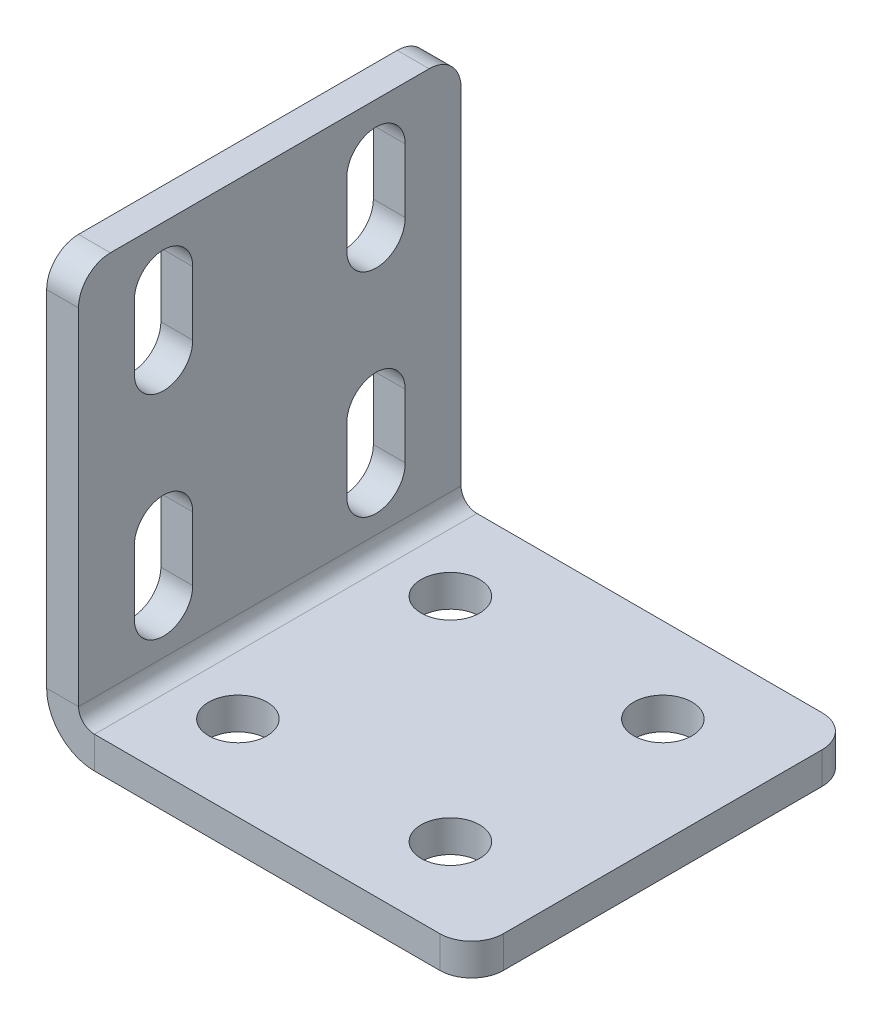
ISO-10303-21;
HEADER;
FILE_DESCRIPTION(('STEP AP214'),'2;1');
FILE_NAME('part.step','',(''),(''),'','','');
FILE_SCHEMA(('AUTOMOTIVE_DESIGN { 1 0 10303 214 1 1 1 1 }'));
ENDSEC;
DATA;
#1=APPLICATION_CONTEXT('core data for automotive mechanical design processes');
#2=APPLICATION_PROTOCOL_DEFINITION('international standard','automotive_design',2000,#1);
#3=PRODUCT_CONTEXT('',#1,'mechanical');
#4=PRODUCT('Part','Part','',(#3));
#5=PRODUCT_RELATED_PRODUCT_CATEGORY('part','',(#4));
#6=PRODUCT_DEFINITION_FORMATION('','',#4);
#7=PRODUCT_DEFINITION_CONTEXT('part definition',#1,'design');
#8=PRODUCT_DEFINITION('design','',#6,#7);
#9=PRODUCT_DEFINITION_SHAPE('','',#8);
#10=(LENGTH_UNIT() NAMED_UNIT(*) SI_UNIT(.MILLI.,.METRE.));
#11=(NAMED_UNIT(*) PLANE_ANGLE_UNIT() SI_UNIT($,.RADIAN.));
#12=(NAMED_UNIT(*) SI_UNIT($,.STERADIAN.) SOLID_ANGLE_UNIT());
#13=UNCERTAINTY_MEASURE_WITH_UNIT(LENGTH_MEASURE(1.E-05),#10,'distance_accuracy_value','');
#14=(GEOMETRIC_REPRESENTATION_CONTEXT(3) GLOBAL_UNCERTAINTY_ASSIGNED_CONTEXT((#13)) GLOBAL_UNIT_ASSIGNED_CONTEXT((#10,
#11,#12)) REPRESENTATION_CONTEXT('',''));
#15=CARTESIAN_POINT('',(0.,0.,0.));
#16=DIRECTION('',(0.,0.,1.));
#17=DIRECTION('',(1.,0.,0.));
#18=AXIS2_PLACEMENT_3D('',#15,#16,#17);
#19=CARTESIAN_POINT('',(0.,29.,-9.99999999999999));
#20=DIRECTION('',(-1.,0.,0.));
#21=DIRECTION('',(0.,0.,1.));
#22=AXIS2_PLACEMENT_3D('',#19,#20,#21);
#23=CYLINDRICAL_SURFACE('',#22,2.75);
#24=CARTESIAN_POINT('',(3.,29.,-9.99999999999999));
#25=DIRECTION('',(1.,0.,0.));
#26=DIRECTION('',(0.,0.,-1.));
#27=AXIS2_PLACEMENT_3D('',#24,#25,#26);
#28=CIRCLE('',#27,2.75);
#29=CARTESIAN_POINT('',(3.,29.,-7.24999999999999));
#30=VERTEX_POINT('',#29);
#31=CARTESIAN_POINT('',(3.,29.,-12.75));
#32=VERTEX_POINT('',#31);
#33=EDGE_CURVE('E496',#30,#32,#28,.T.);
#34=ORIENTED_EDGE('',*,*,#33,.T.);
#35=DIRECTION('',(1.,0.,0.));
#36=VECTOR('',#35,1.);
#37=CARTESIAN_POINT('',(0.,29.,-12.75));
#38=LINE('',#37,#36);
#39=CARTESIAN_POINT('',(0.,29.,-12.75));
#40=VERTEX_POINT('',#39);
#41=EDGE_CURVE('E308',#40,#32,#38,.T.);
#42=ORIENTED_EDGE('',*,*,#41,.F.);
#43=CARTESIAN_POINT('',(0.,29.,-9.99999999999999));
#44=DIRECTION('',(1.,0.,0.));
#45=DIRECTION('',(0.,0.,-1.));
#46=AXIS2_PLACEMENT_3D('',#43,#44,#45);
#47=CIRCLE('',#46,2.75);
#48=CARTESIAN_POINT('',(0.,29.,-7.24999999999999));
#49=VERTEX_POINT('',#48);
#50=EDGE_CURVE('E385',#49,#40,#47,.T.);
#51=ORIENTED_EDGE('',*,*,#50,.F.);
#52=DIRECTION('',(1.,0.,0.));
#53=VECTOR('',#52,1.);
#54=CARTESIAN_POINT('',(0.,29.,-7.24999999999999));
#55=LINE('',#54,#53);
#56=EDGE_CURVE('E311',#49,#30,#55,.T.);
#57=ORIENTED_EDGE('',*,*,#56,.T.);
#58=EDGE_LOOP('',(#34,#42,#51,#57));
#59=FACE_BOUND('',#58,.T.);
#60=ADVANCED_FACE('F46',(#59),#23,.F.);
#61=CARTESIAN_POINT('',(0.,9.,10.));
#62=DIRECTION('',(-1.,0.,0.));
#63=DIRECTION('',(0.,0.,1.));
#64=AXIS2_PLACEMENT_3D('',#61,#62,#63);
#65=CYLINDRICAL_SURFACE('',#64,2.75);
#66=CARTESIAN_POINT('',(3.,9.,10.));
#67=DIRECTION('',(1.,0.,0.));
#68=DIRECTION('',(0.,0.,-1.));
#69=AXIS2_PLACEMENT_3D('',#66,#67,#68);
#70=CIRCLE('',#69,2.75);
#71=CARTESIAN_POINT('',(3.,9.,12.75));
#72=VERTEX_POINT('',#71);
#73=CARTESIAN_POINT('',(3.,9.,7.25));
#74=VERTEX_POINT('',#73);
#75=EDGE_CURVE('E513',#72,#74,#70,.T.);
#76=ORIENTED_EDGE('',*,*,#75,.T.);
#77=DIRECTION('',(1.,0.,0.));
#78=VECTOR('',#77,1.);
#79=CARTESIAN_POINT('',(0.,9.,7.25));
#80=LINE('',#79,#78);
#81=CARTESIAN_POINT('',(0.,9.,7.25));
#82=VERTEX_POINT('',#81);
#83=EDGE_CURVE('E375',#82,#74,#80,.T.);
#84=ORIENTED_EDGE('',*,*,#83,.F.);
#85=CARTESIAN_POINT('',(0.,9.,10.));
#86=DIRECTION('',(1.,0.,0.));
#87=DIRECTION('',(0.,0.,-1.));
#88=AXIS2_PLACEMENT_3D('',#85,#86,#87);
#89=CIRCLE('',#88,2.75);
#90=CARTESIAN_POINT('',(0.,9.,12.75));
#91=VERTEX_POINT('',#90);
#92=EDGE_CURVE('E389',#91,#82,#89,.T.);
#93=ORIENTED_EDGE('',*,*,#92,.F.);
#94=DIRECTION('',(1.,0.,0.));
#95=VECTOR('',#94,1.);
#96=CARTESIAN_POINT('',(0.,9.,12.75));
#97=LINE('',#96,#95);
#98=EDGE_CURVE('E378',#91,#72,#97,.T.);
#99=ORIENTED_EDGE('',*,*,#98,.T.);
#100=EDGE_LOOP('',(#76,#84,#93,#99));
#101=FACE_BOUND('',#100,.T.);
#102=ADVANCED_FACE('F659',(#101),#65,.F.);
#103=CARTESIAN_POINT('',(0.,29.,10.));
#104=DIRECTION('',(-1.,0.,0.));
#105=DIRECTION('',(0.,0.,1.));
#106=AXIS2_PLACEMENT_3D('',#103,#104,#105);
#107=CYLINDRICAL_SURFACE('',#106,2.75);
#108=CARTESIAN_POINT('',(3.,29.,10.));
#109=DIRECTION('',(1.,0.,0.));
#110=DIRECTION('',(0.,0.,-1.));
#111=AXIS2_PLACEMENT_3D('',#108,#109,#110);
#112=CIRCLE('',#111,2.75);
#113=CARTESIAN_POINT('',(3.,29.,12.75));
#114=VERTEX_POINT('',#113);
#115=CARTESIAN_POINT('',(3.,29.,7.25));
#116=VERTEX_POINT('',#115);
#117=EDGE_CURVE('E517',#114,#116,#112,.T.);
#118=ORIENTED_EDGE('',*,*,#117,.T.);
#119=DIRECTION('',(1.,0.,0.));
#120=VECTOR('',#119,1.);
#121=CARTESIAN_POINT('',(0.,29.,7.25));
#122=LINE('',#121,#120);
#123=CARTESIAN_POINT('',(0.,29.,7.25));
#124=VERTEX_POINT('',#123);
#125=EDGE_CURVE('E341',#124,#116,#122,.T.);
#126=ORIENTED_EDGE('',*,*,#125,.F.);
#127=CARTESIAN_POINT('',(0.,29.,10.));
#128=DIRECTION('',(1.,0.,0.));
#129=DIRECTION('',(0.,0.,-1.));
#130=AXIS2_PLACEMENT_3D('',#127,#128,#129);
#131=CIRCLE('',#130,2.75);
#132=CARTESIAN_POINT('',(0.,29.,12.75));
#133=VERTEX_POINT('',#132);
#134=EDGE_CURVE('E394',#133,#124,#131,.T.);
#135=ORIENTED_EDGE('',*,*,#134,.F.);
#136=DIRECTION('',(1.,0.,0.));
#137=VECTOR('',#136,1.);
#138=CARTESIAN_POINT('',(0.,29.,12.75));
#139=LINE('',#138,#137);
#140=EDGE_CURVE('E344',#133,#114,#139,.T.);
#141=ORIENTED_EDGE('',*,*,#140,.T.);
#142=EDGE_LOOP('',(#118,#126,#135,#141));
#143=FACE_BOUND('',#142,.T.);
#144=ADVANCED_FACE('F665',(#143),#107,.F.);
#145=CARTESIAN_POINT('',(0.,8.99999999999999,-9.99999999999999));
#146=DIRECTION('',(-1.,0.,0.));
#147=DIRECTION('',(0.,0.,1.));
#148=AXIS2_PLACEMENT_3D('',#145,#146,#147);
#149=CYLINDRICAL_SURFACE('',#148,2.75);
#150=CARTESIAN_POINT('',(3.,8.99999999999999,-9.99999999999999));
#151=DIRECTION('',(1.,0.,0.));
#152=DIRECTION('',(0.,0.,-1.));
#153=AXIS2_PLACEMENT_3D('',#150,#151,#152);
#154=CIRCLE('',#153,2.75);
#155=CARTESIAN_POINT('',(3.,8.99999999999999,-7.24999999999999));
#156=VERTEX_POINT('',#155);
#157=CARTESIAN_POINT('',(3.,8.99999999999999,-12.75));
#158=VERTEX_POINT('',#157);
#159=EDGE_CURVE('E506',#156,#158,#154,.T.);
#160=ORIENTED_EDGE('',*,*,#159,.T.);
#161=DIRECTION('',(1.,0.,0.));
#162=VECTOR('',#161,1.);
#163=CARTESIAN_POINT('',(0.,8.99999999999999,-12.75));
#164=LINE('',#163,#162);
#165=CARTESIAN_POINT('',(0.,8.99999999999999,-12.75));
#166=VERTEX_POINT('',#165);
#167=EDGE_CURVE('E279',#166,#158,#164,.T.);
#168=ORIENTED_EDGE('',*,*,#167,.F.);
#169=CARTESIAN_POINT('',(0.,8.99999999999999,-9.99999999999999));
#170=DIRECTION('',(1.,0.,0.));
#171=DIRECTION('',(0.,0.,-1.));
#172=AXIS2_PLACEMENT_3D('',#169,#170,#171);
#173=CIRCLE('',#172,2.75);
#174=CARTESIAN_POINT('',(0.,8.99999999999999,-7.24999999999999));
#175=VERTEX_POINT('',#174);
#176=EDGE_CURVE('E398',#175,#166,#173,.T.);
#177=ORIENTED_EDGE('',*,*,#176,.F.);
#178=DIRECTION('',(1.,0.,0.));
#179=VECTOR('',#178,1.);
#180=CARTESIAN_POINT('',(0.,8.99999999999999,-7.24999999999999));
#181=LINE('',#180,#179);
#182=EDGE_CURVE('E243',#175,#156,#181,.T.);
#183=ORIENTED_EDGE('',*,*,#182,.T.);
#184=EDGE_LOOP('',(#160,#168,#177,#183));
#185=FACE_BOUND('',#184,.T.);
#186=ADVANCED_FACE('F673',(#185),#149,.F.);
#187=CARTESIAN_POINT('',(0.,0.,18.));
#188=DIRECTION('',(0.,0.,-1.));
#189=DIRECTION('',(0.,-1.,0.));
#190=AXIS2_PLACEMENT_3D('',#187,#188,#189);
#191=PLANE('',#190);
#192=DIRECTION('',(0.,1.,0.));
#193=VECTOR('',#192,1.);
#194=CARTESIAN_POINT('',(3.,0.,18.));
#195=LINE('',#194,#193);
#196=CARTESIAN_POINT('',(3.,37.,18.));
#197=VERTEX_POINT('',#196);
#198=CARTESIAN_POINT('',(3.,4.5,18.));
#199=VERTEX_POINT('',#198);
#200=EDGE_CURVE('E503',#197,#199,#195,.F.);
#201=ORIENTED_EDGE('',*,*,#200,.F.);
#202=DIRECTION('',(1.,0.,0.));
#203=VECTOR('',#202,1.);
#204=CARTESIAN_POINT('',(0.,37.,18.));
#205=LINE('',#204,#203);
#206=CARTESIAN_POINT('',(0.,37.,18.));
#207=VERTEX_POINT('',#206);
#208=EDGE_CURVE('E11',#197,#207,#205,.F.);
#209=ORIENTED_EDGE('',*,*,#208,.T.);
#210=DIRECTION('',(0.,-1.,0.));
#211=VECTOR('',#210,1.);
#212=CARTESIAN_POINT('',(0.,0.,18.));
#213=LINE('',#212,#211);
#214=CARTESIAN_POINT('',(0.,4.5,18.));
#215=VERTEX_POINT('',#214);
#216=EDGE_CURVE('E401',#207,#215,#213,.T.);
#217=ORIENTED_EDGE('',*,*,#216,.T.);
#218=DIRECTION('',(-1.,0.,0.));
#219=VECTOR('',#218,1.);
#220=CARTESIAN_POINT('',(0.,4.5,18.));
#221=LINE('',#220,#219);
#222=EDGE_CURVE('E531',#199,#215,#221,.T.);
#223=ORIENTED_EDGE('',*,*,#222,.F.);
#224=EDGE_LOOP('',(#201,#209,#217,#223));
#225=FACE_BOUND('',#224,.T.);
#226=ADVANCED_FACE('F616',(#225),#191,.F.);
#227=CARTESIAN_POINT('',(0.,40.,-18.));
#228=DIRECTION('',(0.,-1.,0.));
#229=DIRECTION('',(0.,0.,1.));
#230=AXIS2_PLACEMENT_3D('',#227,#228,#229);
#231=PLANE('',#230);
#232=DIRECTION('',(0.,0.,1.));
#233=VECTOR('',#232,1.);
#234=CARTESIAN_POINT('',(3.,40.,-18.));
#235=LINE('',#234,#233);
#236=CARTESIAN_POINT('',(3.,40.,-15.));
#237=VERTEX_POINT('',#236);
#238=CARTESIAN_POINT('',(3.,40.,15.));
#239=VERTEX_POINT('',#238);
#240=EDGE_CURVE('E499',#237,#239,#235,.T.);
#241=ORIENTED_EDGE('',*,*,#240,.F.);
#242=DIRECTION('',(-1.,0.,0.));
#243=VECTOR('',#242,1.);
#244=CARTESIAN_POINT('',(0.,40.,-15.));
#245=LINE('',#244,#243);
#246=CARTESIAN_POINT('',(0.,40.,-15.));
#247=VERTEX_POINT('',#246);
#248=EDGE_CURVE('E566',#237,#247,#245,.T.);
#249=ORIENTED_EDGE('',*,*,#248,.T.);
#250=DIRECTION('',(0.,0.,1.));
#251=VECTOR('',#250,1.);
#252=CARTESIAN_POINT('',(0.,40.,-18.));
#253=LINE('',#252,#251);
#254=CARTESIAN_POINT('',(0.,40.,15.));
#255=VERTEX_POINT('',#254);
#256=EDGE_CURVE('E404',#247,#255,#253,.T.);
#257=ORIENTED_EDGE('',*,*,#256,.T.);
#258=DIRECTION('',(1.,0.,0.));
#259=VECTOR('',#258,1.);
#260=CARTESIAN_POINT('',(0.,40.,15.));
#261=LINE('',#260,#259);
#262=EDGE_CURVE('E563',#255,#239,#261,.T.);
#263=ORIENTED_EDGE('',*,*,#262,.T.);
#264=EDGE_LOOP('',(#241,#249,#257,#263));
#265=FACE_BOUND('',#264,.T.);
#266=ADVANCED_FACE('F594',(#265),#231,.F.);
#267=CARTESIAN_POINT('',(0.,0.,-18.));
#268=DIRECTION('',(0.,0.,-1.));
#269=DIRECTION('',(0.,-1.,0.));
#270=AXIS2_PLACEMENT_3D('',#267,#268,#269);
#271=PLANE('',#270);
#272=DIRECTION('',(0.,-1.,0.));
#273=VECTOR('',#272,1.);
#274=CARTESIAN_POINT('',(0.,0.,-18.));
#275=LINE('',#274,#273);
#276=CARTESIAN_POINT('',(0.,37.,-18.));
#277=VERTEX_POINT('',#276);
#278=CARTESIAN_POINT('',(0.,4.5,-18.));
#279=VERTEX_POINT('',#278);
#280=EDGE_CURVE('E408',#277,#279,#275,.T.);
#281=ORIENTED_EDGE('',*,*,#280,.F.);
#282=DIRECTION('',(1.,0.,0.));
#283=VECTOR('',#282,1.);
#284=CARTESIAN_POINT('',(0.,37.,-18.));
#285=LINE('',#284,#283);
#286=CARTESIAN_POINT('',(3.,37.,-18.));
#287=VERTEX_POINT('',#286);
#288=EDGE_CURVE('E576',#277,#287,#285,.T.);
#289=ORIENTED_EDGE('',*,*,#288,.T.);
#290=DIRECTION('',(0.,1.,0.));
#291=VECTOR('',#290,1.);
#292=CARTESIAN_POINT('',(3.,0.,-18.));
#293=LINE('',#292,#291);
#294=CARTESIAN_POINT('',(3.,4.5,-18.));
#295=VERTEX_POINT('',#294);
#296=EDGE_CURVE('E469',#287,#295,#293,.F.);
#297=ORIENTED_EDGE('',*,*,#296,.T.);
#298=DIRECTION('',(-1.,0.,0.));
#299=VECTOR('',#298,1.);
#300=CARTESIAN_POINT('',(0.,4.5,-18.));
#301=LINE('',#300,#299);
#302=EDGE_CURVE('E527',#295,#279,#301,.T.);
#303=ORIENTED_EDGE('',*,*,#302,.T.);
#304=EDGE_LOOP('',(#281,#289,#297,#303));
#305=FACE_BOUND('',#304,.T.);
#306=ADVANCED_FACE('F601',(#305),#271,.T.);
#307=CARTESIAN_POINT('',(4.5,4.5,-18.));
#308=DIRECTION('',(0.,0.,1.));
#309=DIRECTION('',(1.,0.,0.));
#310=AXIS2_PLACEMENT_3D('',#307,#308,#309);
#311=PLANE('',#310);
#312=ORIENTED_EDGE('',*,*,#302,.F.);
#313=CARTESIAN_POINT('',(4.5,4.5,-18.));
#314=DIRECTION('',(0.,0.,1.));
#315=DIRECTION('',(1.,0.,0.));
#316=AXIS2_PLACEMENT_3D('',#313,#314,#315);
#317=CIRCLE('',#316,1.5);
#318=CARTESIAN_POINT('',(4.5,3.,-18.));
#319=VERTEX_POINT('',#318);
#320=EDGE_CURVE('E492',#295,#319,#317,.T.);
#321=ORIENTED_EDGE('',*,*,#320,.T.);
#322=DIRECTION('',(0.,-1.,0.));
#323=VECTOR('',#322,1.);
#324=CARTESIAN_POINT('',(4.5,0.,-18.));
#325=LINE('',#324,#323);
#326=CARTESIAN_POINT('',(4.5,0.,-18.));
#327=VERTEX_POINT('',#326);
#328=EDGE_CURVE('E524',#319,#327,#325,.T.);
#329=ORIENTED_EDGE('',*,*,#328,.T.);
#330=CARTESIAN_POINT('',(4.5,4.5,-18.));
#331=DIRECTION('',(0.,0.,-1.));
#332=DIRECTION('',(-1.,0.,0.));
#333=AXIS2_PLACEMENT_3D('',#330,#331,#332);
#334=CIRCLE('',#333,4.5);
#335=EDGE_CURVE('E390',#279,#327,#334,.F.);
#336=ORIENTED_EDGE('',*,*,#335,.F.);
#337=EDGE_LOOP('',(#312,#321,#329,#336));
#338=FACE_BOUND('',#337,.T.);
#339=ADVANCED_FACE('F606',(#338),#311,.F.);
#340=CARTESIAN_POINT('',(40.,0.,-18.));
#341=DIRECTION('',(0.,0.,-1.));
#342=DIRECTION('',(1.,0.,0.));
#343=AXIS2_PLACEMENT_3D('',#340,#341,#342);
#344=PLANE('',#343);
#345=DIRECTION('',(1.,0.,0.));
#346=VECTOR('',#345,1.);
#347=CARTESIAN_POINT('',(40.,3.,-18.));
#348=LINE('',#347,#346);
#349=CARTESIAN_POINT('',(37.,3.,-18.));
#350=VERTEX_POINT('',#349);
#351=EDGE_CURVE('E463',#319,#350,#348,.T.);
#352=ORIENTED_EDGE('',*,*,#351,.T.);
#353=DIRECTION('',(0.,-1.,0.));
#354=VECTOR('',#353,1.);
#355=CARTESIAN_POINT('',(37.,0.,-18.));
#356=LINE('',#355,#354);
#357=CARTESIAN_POINT('',(37.,0.,-18.));
#358=VERTEX_POINT('',#357);
#359=EDGE_CURVE('E535',#350,#358,#356,.T.);
#360=ORIENTED_EDGE('',*,*,#359,.T.);
#361=DIRECTION('',(1.,0.,0.));
#362=VECTOR('',#361,1.);
#363=CARTESIAN_POINT('',(40.,0.,-18.));
#364=LINE('',#363,#362);
#365=EDGE_CURVE('E435',#327,#358,#364,.T.);
#366=ORIENTED_EDGE('',*,*,#365,.F.);
#367=ORIENTED_EDGE('',*,*,#328,.F.);
#368=EDGE_LOOP('',(#352,#360,#366,#367));
#369=FACE_BOUND('',#368,.T.);
#370=ADVANCED_FACE('F649',(#369),#344,.T.);
#371=CARTESIAN_POINT('',(40.,0.,-18.));
#372=DIRECTION('',(1.,0.,0.));
#373=DIRECTION('',(0.,0.,1.));
#374=AXIS2_PLACEMENT_3D('',#371,#372,#373);
#375=PLANE('',#374);
#376=DIRECTION('',(0.,0.,1.));
#377=VECTOR('',#376,1.);
#378=CARTESIAN_POINT('',(40.,0.,-18.));
#379=LINE('',#378,#377);
#380=CARTESIAN_POINT('',(40.,0.,-15.));
#381=VERTEX_POINT('',#380);
#382=CARTESIAN_POINT('',(40.,0.,15.));
#383=VERTEX_POINT('',#382);
#384=EDGE_CURVE('E427',#381,#383,#379,.T.);
#385=ORIENTED_EDGE('',*,*,#384,.F.);
#386=DIRECTION('',(0.,-1.,0.));
#387=VECTOR('',#386,1.);
#388=CARTESIAN_POINT('',(40.,0.,-15.));
#389=LINE('',#388,#387);
#390=CARTESIAN_POINT('',(40.,3.,-15.));
#391=VERTEX_POINT('',#390);
#392=EDGE_CURVE('E551',#381,#391,#389,.F.);
#393=ORIENTED_EDGE('',*,*,#392,.T.);
#394=DIRECTION('',(0.,0.,1.));
#395=VECTOR('',#394,1.);
#396=CARTESIAN_POINT('',(40.,3.,-18.));
#397=LINE('',#396,#395);
#398=CARTESIAN_POINT('',(40.,3.,15.));
#399=VERTEX_POINT('',#398);
#400=EDGE_CURVE('E481',#391,#399,#397,.T.);
#401=ORIENTED_EDGE('',*,*,#400,.T.);
#402=DIRECTION('',(0.,1.,0.));
#403=VECTOR('',#402,1.);
#404=CARTESIAN_POINT('',(40.,0.,15.));
#405=LINE('',#404,#403);
#406=EDGE_CURVE('E547',#399,#383,#405,.F.);
#407=ORIENTED_EDGE('',*,*,#406,.T.);
#408=EDGE_LOOP('',(#385,#393,#401,#407));
#409=FACE_BOUND('',#408,.T.);
#410=ADVANCED_FACE('F640',(#409),#375,.T.);
#411=CARTESIAN_POINT('',(40.,0.,18.));
#412=DIRECTION('',(0.,0.,-1.));
#413=DIRECTION('',(1.,0.,0.));
#414=AXIS2_PLACEMENT_3D('',#411,#412,#413);
#415=PLANE('',#414);
#416=DIRECTION('',(1.,0.,0.));
#417=VECTOR('',#416,1.);
#418=CARTESIAN_POINT('',(40.,0.,18.));
#419=LINE('',#418,#417);
#420=CARTESIAN_POINT('',(4.5,0.,18.));
#421=VERTEX_POINT('',#420);
#422=CARTESIAN_POINT('',(37.,0.,18.));
#423=VERTEX_POINT('',#422);
#424=EDGE_CURVE('E431',#421,#423,#419,.T.);
#425=ORIENTED_EDGE('',*,*,#424,.T.);
#426=DIRECTION('',(0.,-1.,0.));
#427=VECTOR('',#426,1.);
#428=CARTESIAN_POINT('',(37.,0.,18.));
#429=LINE('',#428,#427);
#430=CARTESIAN_POINT('',(37.,3.,18.));
#431=VERTEX_POINT('',#430);
#432=EDGE_CURVE('E560',#423,#431,#429,.F.);
#433=ORIENTED_EDGE('',*,*,#432,.T.);
#434=DIRECTION('',(1.,0.,0.));
#435=VECTOR('',#434,1.);
#436=CARTESIAN_POINT('',(40.,3.,18.));
#437=LINE('',#436,#435);
#438=CARTESIAN_POINT('',(4.5,3.,18.));
#439=VERTEX_POINT('',#438);
#440=EDGE_CURVE('E482',#439,#431,#437,.T.);
#441=ORIENTED_EDGE('',*,*,#440,.F.);
#442=DIRECTION('',(0.,-1.,0.));
#443=VECTOR('',#442,1.);
#444=CARTESIAN_POINT('',(4.5,0.,18.));
#445=LINE('',#444,#443);
#446=EDGE_CURVE('E447',#439,#421,#445,.T.);
#447=ORIENTED_EDGE('',*,*,#446,.T.);
#448=EDGE_LOOP('',(#425,#433,#441,#447));
#449=FACE_BOUND('',#448,.T.);
#450=ADVANCED_FACE('F627',(#449),#415,.F.);
#451=CARTESIAN_POINT('',(10.,0.,-10.));
#452=DIRECTION('',(0.,-1.,0.));
#453=DIRECTION('',(1.,0.,0.));
#454=AXIS2_PLACEMENT_3D('',#451,#452,#453);
#455=CYLINDRICAL_SURFACE('',#454,2.75);
#456=CARTESIAN_POINT('',(10.,0.,-10.));
#457=DIRECTION('',(0.,-1.,0.));
#458=DIRECTION('',(0.,0.,-1.));
#459=AXIS2_PLACEMENT_3D('',#456,#457,#458);
#460=CIRCLE('',#459,2.75);
#461=CARTESIAN_POINT('',(10.,0.,-12.75));
#462=VERTEX_POINT('',#461);
#463=EDGE_CURVE('E411',#462,#462,#460,.T.);
#464=ORIENTED_EDGE('',*,*,#463,.T.);
#465=EDGE_LOOP('',(#464));
#466=FACE_BOUND('',#465,.T.);
#467=CARTESIAN_POINT('',(10.,3.,-10.));
#468=DIRECTION('',(0.,-1.,0.));
#469=DIRECTION('',(0.,0.,-1.));
#470=AXIS2_PLACEMENT_3D('',#467,#468,#469);
#471=CIRCLE('',#470,2.75);
#472=CARTESIAN_POINT('',(10.,3.,-12.75));
#473=VERTEX_POINT('',#472);
#474=EDGE_CURVE('E464',#473,#473,#471,.T.);
#475=ORIENTED_EDGE('',*,*,#474,.F.);
#476=EDGE_LOOP('',(#475));
#477=FACE_BOUND('',#476,.T.);
#478=ADVANCED_FACE('F717',(#466,#477),#455,.F.);
#479=CARTESIAN_POINT('',(30.,0.,10.));
#480=DIRECTION('',(0.,-1.,0.));
#481=DIRECTION('',(1.,0.,0.));
#482=AXIS2_PLACEMENT_3D('',#479,#480,#481);
#483=CYLINDRICAL_SURFACE('',#482,2.75);
#484=CARTESIAN_POINT('',(30.,0.,10.));
#485=DIRECTION('',(0.,-1.,0.));
#486=DIRECTION('',(0.,0.,-1.));
#487=AXIS2_PLACEMENT_3D('',#484,#485,#486);
#488=CIRCLE('',#487,2.75);
#489=CARTESIAN_POINT('',(30.,0.,7.25000000000001));
#490=VERTEX_POINT('',#489);
#491=EDGE_CURVE('E415',#490,#490,#488,.T.);
#492=ORIENTED_EDGE('',*,*,#491,.T.);
#493=EDGE_LOOP('',(#492));
#494=FACE_BOUND('',#493,.T.);
#495=CARTESIAN_POINT('',(30.,3.,10.));
#496=DIRECTION('',(0.,-1.,0.));
#497=DIRECTION('',(0.,0.,-1.));
#498=AXIS2_PLACEMENT_3D('',#495,#496,#497);
#499=CIRCLE('',#498,2.75);
#500=CARTESIAN_POINT('',(30.,3.,7.25000000000001));
#501=VERTEX_POINT('',#500);
#502=EDGE_CURVE('E468',#501,#501,#499,.T.);
#503=ORIENTED_EDGE('',*,*,#502,.F.);
#504=EDGE_LOOP('',(#503));
#505=FACE_BOUND('',#504,.T.);
#506=ADVANCED_FACE('F720',(#494,#505),#483,.F.);
#507=CARTESIAN_POINT('',(30.,0.,-9.99999999999999));
#508=DIRECTION('',(0.,-1.,0.));
#509=DIRECTION('',(1.,0.,0.));
#510=AXIS2_PLACEMENT_3D('',#507,#508,#509);
#511=CYLINDRICAL_SURFACE('',#510,2.75);
#512=CARTESIAN_POINT('',(30.,0.,-9.99999999999999));
#513=DIRECTION('',(0.,-1.,0.));
#514=DIRECTION('',(0.,0.,-1.));
#515=AXIS2_PLACEMENT_3D('',#512,#513,#514);
#516=CIRCLE('',#515,2.75);
#517=CARTESIAN_POINT('',(30.,0.,-12.75));
#518=VERTEX_POINT('',#517);
#519=EDGE_CURVE('E419',#518,#518,#516,.T.);
#520=ORIENTED_EDGE('',*,*,#519,.T.);
#521=EDGE_LOOP('',(#520));
#522=FACE_BOUND('',#521,.T.);
#523=CARTESIAN_POINT('',(30.,3.,-9.99999999999999));
#524=DIRECTION('',(0.,-1.,0.));
#525=DIRECTION('',(0.,0.,-1.));
#526=AXIS2_PLACEMENT_3D('',#523,#524,#525);
#527=CIRCLE('',#526,2.75);
#528=CARTESIAN_POINT('',(30.,3.,-12.75));
#529=VERTEX_POINT('',#528);
#530=EDGE_CURVE('E473',#529,#529,#527,.T.);
#531=ORIENTED_EDGE('',*,*,#530,.F.);
#532=EDGE_LOOP('',(#531));
#533=FACE_BOUND('',#532,.T.);
#534=ADVANCED_FACE('F724',(#522,#533),#511,.F.);
#535=CARTESIAN_POINT('',(10.,0.,10.));
#536=DIRECTION('',(0.,-1.,0.));
#537=DIRECTION('',(1.,0.,0.));
#538=AXIS2_PLACEMENT_3D('',#535,#536,#537);
#539=CYLINDRICAL_SURFACE('',#538,2.75);
#540=CARTESIAN_POINT('',(10.,0.,10.));
#541=DIRECTION('',(0.,-1.,0.));
#542=DIRECTION('',(0.,0.,-1.));
#543=AXIS2_PLACEMENT_3D('',#540,#541,#542);
#544=CIRCLE('',#543,2.75);
#545=CARTESIAN_POINT('',(10.,0.,7.25000000000001));
#546=VERTEX_POINT('',#545);
#547=EDGE_CURVE('E423',#546,#546,#544,.T.);
#548=ORIENTED_EDGE('',*,*,#547,.T.);
#549=EDGE_LOOP('',(#548));
#550=FACE_BOUND('',#549,.T.);
#551=CARTESIAN_POINT('',(10.,3.,10.));
#552=DIRECTION('',(0.,-1.,0.));
#553=DIRECTION('',(0.,0.,-1.));
#554=AXIS2_PLACEMENT_3D('',#551,#552,#553);
#555=CIRCLE('',#554,2.75);
#556=CARTESIAN_POINT('',(10.,3.,7.25000000000001));
#557=VERTEX_POINT('',#556);
#558=EDGE_CURVE('E477',#557,#557,#555,.T.);
#559=ORIENTED_EDGE('',*,*,#558,.F.);
#560=EDGE_LOOP('',(#559));
#561=FACE_BOUND('',#560,.T.);
#562=ADVANCED_FACE('F728',(#550,#561),#539,.F.);
#563=CARTESIAN_POINT('',(4.5,4.5,18.));
#564=DIRECTION('',(0.,0.,-1.));
#565=DIRECTION('',(-1.,0.,0.));
#566=AXIS2_PLACEMENT_3D('',#563,#564,#565);
#567=PLANE('',#566);
#568=CARTESIAN_POINT('',(4.5,4.5,18.));
#569=DIRECTION('',(0.,0.,1.));
#570=DIRECTION('',(1.,0.,0.));
#571=AXIS2_PLACEMENT_3D('',#568,#569,#570);
#572=CIRCLE('',#571,1.5);
#573=EDGE_CURVE('E374',#439,#199,#572,.F.);
#574=ORIENTED_EDGE('',*,*,#573,.T.);
#575=ORIENTED_EDGE('',*,*,#222,.T.);
#576=CARTESIAN_POINT('',(4.5,4.5,18.));
#577=DIRECTION('',(0.,0.,1.));
#578=DIRECTION('',(1.,0.,0.));
#579=AXIS2_PLACEMENT_3D('',#576,#577,#578);
#580=CIRCLE('',#579,4.5);
#581=EDGE_CURVE('E448',#421,#215,#580,.F.);
#582=ORIENTED_EDGE('',*,*,#581,.F.);
#583=ORIENTED_EDGE('',*,*,#446,.F.);
#584=EDGE_LOOP('',(#574,#575,#582,#583));
#585=FACE_BOUND('',#584,.T.);
#586=ADVANCED_FACE('F619',(#585),#567,.F.);
#587=CARTESIAN_POINT('',(40.,0.,-18.));
#588=DIRECTION('',(0.,-1.,0.));
#589=DIRECTION('',(1.,0.,0.));
#590=AXIS2_PLACEMENT_3D('',#587,#588,#589);
#591=PLANE('',#590);
#592=ORIENTED_EDGE('',*,*,#463,.F.);
#593=EDGE_LOOP('',(#592));
#594=FACE_BOUND('',#593,.T.);
#595=ORIENTED_EDGE('',*,*,#491,.F.);
#596=EDGE_LOOP('',(#595));
#597=FACE_BOUND('',#596,.T.);
#598=ORIENTED_EDGE('',*,*,#519,.F.);
#599=EDGE_LOOP('',(#598));
#600=FACE_BOUND('',#599,.T.);
#601=ORIENTED_EDGE('',*,*,#547,.F.);
#602=EDGE_LOOP('',(#601));
#603=FACE_BOUND('',#602,.T.);
#604=ORIENTED_EDGE('',*,*,#365,.T.);
#605=CARTESIAN_POINT('',(37.,0.,-15.));
#606=DIRECTION('',(0.,-1.,0.));
#607=DIRECTION('',(1.,0.,0.));
#608=AXIS2_PLACEMENT_3D('',#605,#606,#607);
#609=CIRCLE('',#608,3.);
#610=EDGE_CURVE('E544',#358,#381,#609,.T.);
#611=ORIENTED_EDGE('',*,*,#610,.T.);
#612=ORIENTED_EDGE('',*,*,#384,.T.);
#613=CARTESIAN_POINT('',(37.,0.,15.));
#614=DIRECTION('',(0.,-1.,0.));
#615=DIRECTION('',(1.,0.,0.));
#616=AXIS2_PLACEMENT_3D('',#613,#614,#615);
#617=CIRCLE('',#616,3.);
#618=EDGE_CURVE('E541',#383,#423,#617,.T.);
#619=ORIENTED_EDGE('',*,*,#618,.T.);
#620=ORIENTED_EDGE('',*,*,#424,.F.);
#621=DIRECTION('',(0.,0.,1.));
#622=VECTOR('',#621,1.);
#623=CARTESIAN_POINT('',(4.5,0.,-18.));
#624=LINE('',#623,#622);
#625=EDGE_CURVE('E443',#421,#327,#624,.F.);
#626=ORIENTED_EDGE('',*,*,#625,.T.);
#627=EDGE_LOOP('',(#604,#611,#612,#619,#620,#626));
#628=FACE_BOUND('',#627,.T.);
#629=ADVANCED_FACE('F643',(#594,#597,#600,#603,#628),#591,.T.);
#630=CARTESIAN_POINT('',(0.,0.,-18.));
#631=DIRECTION('',(-1.,0.,0.));
#632=DIRECTION('',(0.,0.,1.));
#633=AXIS2_PLACEMENT_3D('',#630,#631,#632);
#634=PLANE('',#633);
#635=DIRECTION('',(0.,1.,0.));
#636=VECTOR('',#635,1.);
#637=CARTESIAN_POINT('',(0.,35.,7.25));
#638=LINE('',#637,#636);
#639=CARTESIAN_POINT('',(0.,35.,7.25));
#640=VERTEX_POINT('',#639);
#641=EDGE_CURVE('E326',#124,#640,#638,.T.);
#642=ORIENTED_EDGE('',*,*,#641,.T.);
#643=CARTESIAN_POINT('',(0.,35.,10.));
#644=DIRECTION('',(1.,0.,0.));
#645=DIRECTION('',(0.,0.,-1.));
#646=AXIS2_PLACEMENT_3D('',#643,#644,#645);
#647=CIRCLE('',#646,2.75);
#648=CARTESIAN_POINT('',(0.,35.,12.75));
#649=VERTEX_POINT('',#648);
#650=EDGE_CURVE('E317',#640,#649,#647,.T.);
#651=ORIENTED_EDGE('',*,*,#650,.T.);
#652=DIRECTION('',(0.,-1.,0.));
#653=VECTOR('',#652,1.);
#654=CARTESIAN_POINT('',(0.,35.,12.75));
#655=LINE('',#654,#653);
#656=EDGE_CURVE('E321',#649,#133,#655,.T.);
#657=ORIENTED_EDGE('',*,*,#656,.T.);
#658=ORIENTED_EDGE('',*,*,#134,.T.);
#659=EDGE_LOOP('',(#642,#651,#657,#658));
#660=FACE_BOUND('',#659,.T.);
#661=DIRECTION('',(0.,1.,0.));
#662=VECTOR('',#661,1.);
#663=CARTESIAN_POINT('',(0.,35.,-12.75));
#664=LINE('',#663,#662);
#665=CARTESIAN_POINT('',(0.,35.,-12.75));
#666=VERTEX_POINT('',#665);
#667=EDGE_CURVE('E292',#40,#666,#664,.T.);
#668=ORIENTED_EDGE('',*,*,#667,.T.);
#669=CARTESIAN_POINT('',(0.,35.,-9.99999999999999));
#670=DIRECTION('',(1.,0.,0.));
#671=DIRECTION('',(0.,0.,-1.));
#672=AXIS2_PLACEMENT_3D('',#669,#670,#671);
#673=CIRCLE('',#672,2.75);
#674=CARTESIAN_POINT('',(0.,35.,-7.24999999999999));
#675=VERTEX_POINT('',#674);
#676=EDGE_CURVE('E284',#666,#675,#673,.T.);
#677=ORIENTED_EDGE('',*,*,#676,.T.);
#678=DIRECTION('',(0.,-1.,0.));
#679=VECTOR('',#678,1.);
#680=CARTESIAN_POINT('',(0.,35.,-7.24999999999999));
#681=LINE('',#680,#679);
#682=EDGE_CURVE('E288',#675,#49,#681,.T.);
#683=ORIENTED_EDGE('',*,*,#682,.T.);
#684=ORIENTED_EDGE('',*,*,#50,.T.);
#685=EDGE_LOOP('',(#668,#677,#683,#684));
#686=FACE_BOUND('',#685,.T.);
#687=DIRECTION('',(0.,1.,0.));
#688=VECTOR('',#687,1.);
#689=CARTESIAN_POINT('',(0.,15.,-12.75));
#690=LINE('',#689,#688);
#691=CARTESIAN_POINT('',(0.,15.,-12.75));
#692=VERTEX_POINT('',#691);
#693=EDGE_CURVE('E244',#166,#692,#690,.T.);
#694=ORIENTED_EDGE('',*,*,#693,.T.);
#695=CARTESIAN_POINT('',(0.,15.,-10.));
#696=DIRECTION('',(1.,0.,0.));
#697=DIRECTION('',(0.,0.,-1.));
#698=AXIS2_PLACEMENT_3D('',#695,#696,#697);
#699=CIRCLE('',#698,2.75);
#700=CARTESIAN_POINT('',(0.,15.,-7.24999999999999));
#701=VERTEX_POINT('',#700);
#702=EDGE_CURVE('E236',#692,#701,#699,.T.);
#703=ORIENTED_EDGE('',*,*,#702,.T.);
#704=DIRECTION('',(0.,-1.,0.));
#705=VECTOR('',#704,1.);
#706=CARTESIAN_POINT('',(0.,15.,-7.24999999999999));
#707=LINE('',#706,#705);
#708=EDGE_CURVE('E247',#701,#175,#707,.T.);
#709=ORIENTED_EDGE('',*,*,#708,.T.);
#710=ORIENTED_EDGE('',*,*,#176,.T.);
#711=EDGE_LOOP('',(#694,#703,#709,#710));
#712=FACE_BOUND('',#711,.T.);
#713=DIRECTION('',(0.,1.,0.));
#714=VECTOR('',#713,1.);
#715=CARTESIAN_POINT('',(0.,15.,7.25));
#716=LINE('',#715,#714);
#717=CARTESIAN_POINT('',(0.,15.,7.25));
#718=VERTEX_POINT('',#717);
#719=EDGE_CURVE('E358',#82,#718,#716,.T.);
#720=ORIENTED_EDGE('',*,*,#719,.T.);
#721=CARTESIAN_POINT('',(0.,15.,10.));
#722=DIRECTION('',(1.,0.,0.));
#723=DIRECTION('',(0.,0.,-1.));
#724=AXIS2_PLACEMENT_3D('',#721,#722,#723);
#725=CIRCLE('',#724,2.75);
#726=CARTESIAN_POINT('',(0.,15.,12.75));
#727=VERTEX_POINT('',#726);
#728=EDGE_CURVE('E350',#718,#727,#725,.T.);
#729=ORIENTED_EDGE('',*,*,#728,.T.);
#730=DIRECTION('',(0.,-1.,0.));
#731=VECTOR('',#730,1.);
#732=CARTESIAN_POINT('',(0.,15.,12.75));
#733=LINE('',#732,#731);
#734=EDGE_CURVE('E353',#727,#91,#733,.T.);
#735=ORIENTED_EDGE('',*,*,#734,.T.);
#736=ORIENTED_EDGE('',*,*,#92,.T.);
#737=EDGE_LOOP('',(#720,#729,#735,#736));
#738=FACE_BOUND('',#737,.T.);
#739=ORIENTED_EDGE('',*,*,#256,.F.);
#740=CARTESIAN_POINT('',(0.,37.,-15.));
#741=DIRECTION('',(-1.,0.,0.));
#742=DIRECTION('',(0.,0.,1.));
#743=AXIS2_PLACEMENT_3D('',#740,#741,#742);
#744=CIRCLE('',#743,3.);
#745=EDGE_CURVE('E573',#247,#277,#744,.T.);
#746=ORIENTED_EDGE('',*,*,#745,.T.);
#747=ORIENTED_EDGE('',*,*,#280,.T.);
#748=DIRECTION('',(0.,0.,1.));
#749=VECTOR('',#748,1.);
#750=CARTESIAN_POINT('',(0.,4.5,-18.));
#751=LINE('',#750,#749);
#752=EDGE_CURVE('E439',#279,#215,#751,.T.);
#753=ORIENTED_EDGE('',*,*,#752,.T.);
#754=ORIENTED_EDGE('',*,*,#216,.F.);
#755=CARTESIAN_POINT('',(0.,37.,15.));
#756=DIRECTION('',(-1.,0.,0.));
#757=DIRECTION('',(0.,0.,1.));
#758=AXIS2_PLACEMENT_3D('',#755,#756,#757);
#759=CIRCLE('',#758,3.);
#760=EDGE_CURVE('E570',#207,#255,#759,.T.);
#761=ORIENTED_EDGE('',*,*,#760,.T.);
#762=EDGE_LOOP('',(#739,#746,#747,#753,#754,#761));
#763=FACE_BOUND('',#762,.T.);
#764=ADVANCED_FACE('F255',(#660,#686,#712,#738,#763),#634,.T.);
#765=CARTESIAN_POINT('',(4.5,4.5,-18.));
#766=DIRECTION('',(0.,0.,1.));
#767=DIRECTION('',(1.,0.,0.));
#768=AXIS2_PLACEMENT_3D('',#765,#766,#767);
#769=CYLINDRICAL_SURFACE('',#768,4.5);
#770=ORIENTED_EDGE('',*,*,#335,.T.);
#771=ORIENTED_EDGE('',*,*,#625,.F.);
#772=ORIENTED_EDGE('',*,*,#581,.T.);
#773=ORIENTED_EDGE('',*,*,#752,.F.);
#774=EDGE_LOOP('',(#770,#771,#772,#773));
#775=FACE_BOUND('',#774,.T.);
#776=ADVANCED_FACE('F610',(#775),#769,.T.);
#777=CARTESIAN_POINT('',(40.,3.,-18.));
#778=DIRECTION('',(0.,-1.,0.));
#779=DIRECTION('',(1.,0.,0.));
#780=AXIS2_PLACEMENT_3D('',#777,#778,#779);
#781=PLANE('',#780);
#782=ORIENTED_EDGE('',*,*,#474,.T.);
#783=EDGE_LOOP('',(#782));
#784=FACE_BOUND('',#783,.T.);
#785=ORIENTED_EDGE('',*,*,#502,.T.);
#786=EDGE_LOOP('',(#785));
#787=FACE_BOUND('',#786,.T.);
#788=ORIENTED_EDGE('',*,*,#530,.T.);
#789=EDGE_LOOP('',(#788));
#790=FACE_BOUND('',#789,.T.);
#791=ORIENTED_EDGE('',*,*,#558,.T.);
#792=EDGE_LOOP('',(#791));
#793=FACE_BOUND('',#792,.T.);
#794=ORIENTED_EDGE('',*,*,#400,.F.);
#795=CARTESIAN_POINT('',(37.,3.,-15.));
#796=DIRECTION('',(0.,-1.,0.));
#797=DIRECTION('',(1.,0.,0.));
#798=AXIS2_PLACEMENT_3D('',#795,#796,#797);
#799=CIRCLE('',#798,3.);
#800=EDGE_CURVE('E557',#391,#350,#799,.F.);
#801=ORIENTED_EDGE('',*,*,#800,.T.);
#802=ORIENTED_EDGE('',*,*,#351,.F.);
#803=DIRECTION('',(0.,0.,1.));
#804=VECTOR('',#803,1.);
#805=CARTESIAN_POINT('',(4.5,3.,-18.));
#806=LINE('',#805,#804);
#807=EDGE_CURVE('E452',#439,#319,#806,.F.);
#808=ORIENTED_EDGE('',*,*,#807,.F.);
#809=ORIENTED_EDGE('',*,*,#440,.T.);
#810=CARTESIAN_POINT('',(37.,3.,15.));
#811=DIRECTION('',(0.,-1.,0.));
#812=DIRECTION('',(1.,0.,0.));
#813=AXIS2_PLACEMENT_3D('',#810,#811,#812);
#814=CIRCLE('',#813,3.);
#815=EDGE_CURVE('E554',#431,#399,#814,.F.);
#816=ORIENTED_EDGE('',*,*,#815,.T.);
#817=EDGE_LOOP('',(#794,#801,#802,#808,#809,#816));
#818=FACE_BOUND('',#817,.T.);
#819=ADVANCED_FACE('F633',(#784,#787,#790,#793,#818),#781,.F.);
#820=CARTESIAN_POINT('',(3.,0.,-18.));
#821=DIRECTION('',(-1.,0.,0.));
#822=DIRECTION('',(0.,0.,1.));
#823=AXIS2_PLACEMENT_3D('',#820,#821,#822);
#824=PLANE('',#823);
#825=CARTESIAN_POINT('',(3.,35.,-9.99999999999999));
#826=DIRECTION('',(1.,0.,0.));
#827=DIRECTION('',(0.,0.,-1.));
#828=AXIS2_PLACEMENT_3D('',#825,#826,#827);
#829=CIRCLE('',#828,2.75);
#830=CARTESIAN_POINT('',(3.,35.,-12.75));
#831=VERTEX_POINT('',#830);
#832=CARTESIAN_POINT('',(3.,35.,-7.24999999999999));
#833=VERTEX_POINT('',#832);
#834=EDGE_CURVE('E70',#831,#833,#829,.T.);
#835=ORIENTED_EDGE('',*,*,#834,.F.);
#836=DIRECTION('',(0.,1.,0.));
#837=VECTOR('',#836,1.);
#838=CARTESIAN_POINT('',(3.,35.,-12.75));
#839=LINE('',#838,#837);
#840=EDGE_CURVE('E289',#32,#831,#839,.T.);
#841=ORIENTED_EDGE('',*,*,#840,.F.);
#842=ORIENTED_EDGE('',*,*,#33,.F.);
#843=DIRECTION('',(0.,-1.,0.));
#844=VECTOR('',#843,1.);
#845=CARTESIAN_POINT('',(3.,35.,-7.24999999999999));
#846=LINE('',#845,#844);
#847=EDGE_CURVE('E299',#833,#30,#846,.T.);
#848=ORIENTED_EDGE('',*,*,#847,.F.);
#849=EDGE_LOOP('',(#835,#841,#842,#848));
#850=FACE_BOUND('',#849,.T.);
#851=CARTESIAN_POINT('',(3.,15.,10.));
#852=DIRECTION('',(1.,0.,0.));
#853=DIRECTION('',(0.,0.,-1.));
#854=AXIS2_PLACEMENT_3D('',#851,#852,#853);
#855=CIRCLE('',#854,2.75);
#856=CARTESIAN_POINT('',(3.,15.,7.25));
#857=VERTEX_POINT('',#856);
#858=CARTESIAN_POINT('',(3.,15.,12.75));
#859=VERTEX_POINT('',#858);
#860=EDGE_CURVE('E278',#857,#859,#855,.T.);
#861=ORIENTED_EDGE('',*,*,#860,.F.);
#862=DIRECTION('',(0.,1.,0.));
#863=VECTOR('',#862,1.);
#864=CARTESIAN_POINT('',(3.,15.,7.25));
#865=LINE('',#864,#863);
#866=EDGE_CURVE('E354',#74,#857,#865,.T.);
#867=ORIENTED_EDGE('',*,*,#866,.F.);
#868=ORIENTED_EDGE('',*,*,#75,.F.);
#869=DIRECTION('',(0.,-1.,0.));
#870=VECTOR('',#869,1.);
#871=CARTESIAN_POINT('',(3.,15.,12.75));
#872=LINE('',#871,#870);
#873=EDGE_CURVE('E365',#859,#72,#872,.T.);
#874=ORIENTED_EDGE('',*,*,#873,.F.);
#875=EDGE_LOOP('',(#861,#867,#868,#874));
#876=FACE_BOUND('',#875,.T.);
#877=CARTESIAN_POINT('',(3.,35.,10.));
#878=DIRECTION('',(1.,0.,0.));
#879=DIRECTION('',(0.,0.,-1.));
#880=AXIS2_PLACEMENT_3D('',#877,#878,#879);
#881=CIRCLE('',#880,2.75);
#882=CARTESIAN_POINT('',(3.,35.,7.25));
#883=VERTEX_POINT('',#882);
#884=CARTESIAN_POINT('',(3.,35.,12.75));
#885=VERTEX_POINT('',#884);
#886=EDGE_CURVE('E62',#883,#885,#881,.T.);
#887=ORIENTED_EDGE('',*,*,#886,.F.);
#888=DIRECTION('',(0.,1.,0.));
#889=VECTOR('',#888,1.);
#890=CARTESIAN_POINT('',(3.,35.,7.25));
#891=LINE('',#890,#889);
#892=EDGE_CURVE('E322',#116,#883,#891,.T.);
#893=ORIENTED_EDGE('',*,*,#892,.F.);
#894=ORIENTED_EDGE('',*,*,#117,.F.);
#895=DIRECTION('',(0.,-1.,0.));
#896=VECTOR('',#895,1.);
#897=CARTESIAN_POINT('',(3.,35.,12.75));
#898=LINE('',#897,#896);
#899=EDGE_CURVE('E333',#885,#114,#898,.T.);
#900=ORIENTED_EDGE('',*,*,#899,.F.);
#901=EDGE_LOOP('',(#887,#893,#894,#900));
#902=FACE_BOUND('',#901,.T.);
#903=CARTESIAN_POINT('',(3.,15.,-10.));
#904=DIRECTION('',(1.,0.,0.));
#905=DIRECTION('',(0.,0.,-1.));
#906=AXIS2_PLACEMENT_3D('',#903,#904,#905);
#907=CIRCLE('',#906,2.75);
#908=CARTESIAN_POINT('',(3.,15.,-12.75));
#909=VERTEX_POINT('',#908);
#910=CARTESIAN_POINT('',(3.,15.,-7.24999999999999));
#911=VERTEX_POINT('',#910);
#912=EDGE_CURVE('E239',#909,#911,#907,.T.);
#913=ORIENTED_EDGE('',*,*,#912,.F.);
#914=DIRECTION('',(0.,1.,0.));
#915=VECTOR('',#914,1.);
#916=CARTESIAN_POINT('',(3.,15.,-12.75));
#917=LINE('',#916,#915);
#918=EDGE_CURVE('E258',#158,#909,#917,.T.);
#919=ORIENTED_EDGE('',*,*,#918,.F.);
#920=ORIENTED_EDGE('',*,*,#159,.F.);
#921=DIRECTION('',(0.,-1.,0.));
#922=VECTOR('',#921,1.);
#923=CARTESIAN_POINT('',(3.,15.,-7.24999999999999));
#924=LINE('',#923,#922);
#925=EDGE_CURVE('E265',#911,#156,#924,.T.);
#926=ORIENTED_EDGE('',*,*,#925,.F.);
#927=EDGE_LOOP('',(#913,#919,#920,#926));
#928=FACE_BOUND('',#927,.T.);
#929=ORIENTED_EDGE('',*,*,#296,.F.);
#930=CARTESIAN_POINT('',(3.,37.,-15.));
#931=DIRECTION('',(-1.,0.,0.));
#932=DIRECTION('',(0.,0.,1.));
#933=AXIS2_PLACEMENT_3D('',#930,#931,#932);
#934=CIRCLE('',#933,3.);
#935=EDGE_CURVE('E55',#287,#237,#934,.F.);
#936=ORIENTED_EDGE('',*,*,#935,.T.);
#937=ORIENTED_EDGE('',*,*,#240,.T.);
#938=CARTESIAN_POINT('',(3.,37.,15.));
#939=DIRECTION('',(-1.,0.,0.));
#940=DIRECTION('',(0.,0.,1.));
#941=AXIS2_PLACEMENT_3D('',#938,#939,#940);
#942=CIRCLE('',#941,3.);
#943=EDGE_CURVE('E579',#239,#197,#942,.F.);
#944=ORIENTED_EDGE('',*,*,#943,.T.);
#945=ORIENTED_EDGE('',*,*,#200,.T.);
#946=DIRECTION('',(0.,0.,1.));
#947=VECTOR('',#946,1.);
#948=CARTESIAN_POINT('',(3.,4.5,-18.));
#949=LINE('',#948,#947);
#950=EDGE_CURVE('E459',#295,#199,#949,.T.);
#951=ORIENTED_EDGE('',*,*,#950,.F.);
#952=EDGE_LOOP('',(#929,#936,#937,#944,#945,#951));
#953=FACE_BOUND('',#952,.T.);
#954=ADVANCED_FACE('F587',(#850,#876,#902,#928,#953),#824,.F.);
#955=CARTESIAN_POINT('',(4.5,4.5,-18.));
#956=DIRECTION('',(0.,0.,1.));
#957=DIRECTION('',(1.,0.,0.));
#958=AXIS2_PLACEMENT_3D('',#955,#956,#957);
#959=CYLINDRICAL_SURFACE('',#958,1.5);
#960=ORIENTED_EDGE('',*,*,#320,.F.);
#961=ORIENTED_EDGE('',*,*,#950,.T.);
#962=ORIENTED_EDGE('',*,*,#573,.F.);
#963=ORIENTED_EDGE('',*,*,#807,.T.);
#964=EDGE_LOOP('',(#960,#961,#962,#963));
#965=FACE_BOUND('',#964,.T.);
#966=ADVANCED_FACE('F625',(#965),#959,.F.);
#967=CARTESIAN_POINT('',(37.,0.,-15.));
#968=DIRECTION('',(0.,-1.,0.));
#969=DIRECTION('',(1.,0.,0.));
#970=AXIS2_PLACEMENT_3D('',#967,#968,#969);
#971=CYLINDRICAL_SURFACE('',#970,3.);
#972=ORIENTED_EDGE('',*,*,#800,.F.);
#973=ORIENTED_EDGE('',*,*,#392,.F.);
#974=ORIENTED_EDGE('',*,*,#610,.F.);
#975=ORIENTED_EDGE('',*,*,#359,.F.);
#976=EDGE_LOOP('',(#972,#973,#974,#975));
#977=FACE_BOUND('',#976,.T.);
#978=ADVANCED_FACE('F647',(#977),#971,.T.);
#979=CARTESIAN_POINT('',(37.,0.,15.));
#980=DIRECTION('',(0.,1.,0.));
#981=DIRECTION('',(-1.,0.,0.));
#982=AXIS2_PLACEMENT_3D('',#979,#980,#981);
#983=CYLINDRICAL_SURFACE('',#982,3.);
#984=ORIENTED_EDGE('',*,*,#815,.F.);
#985=ORIENTED_EDGE('',*,*,#432,.F.);
#986=ORIENTED_EDGE('',*,*,#618,.F.);
#987=ORIENTED_EDGE('',*,*,#406,.F.);
#988=EDGE_LOOP('',(#984,#985,#986,#987));
#989=FACE_BOUND('',#988,.T.);
#990=ADVANCED_FACE('F637',(#989),#983,.T.);
#991=CARTESIAN_POINT('',(0.,37.,-15.));
#992=DIRECTION('',(1.,0.,0.));
#993=DIRECTION('',(0.,0.,-1.));
#994=AXIS2_PLACEMENT_3D('',#991,#992,#993);
#995=CYLINDRICAL_SURFACE('',#994,3.);
#996=ORIENTED_EDGE('',*,*,#935,.F.);
#997=ORIENTED_EDGE('',*,*,#288,.F.);
#998=ORIENTED_EDGE('',*,*,#745,.F.);
#999=ORIENTED_EDGE('',*,*,#248,.F.);
#1000=EDGE_LOOP('',(#996,#997,#998,#999));
#1001=FACE_BOUND('',#1000,.T.);
#1002=ADVANCED_FACE('F597',(#1001),#995,.T.);
#1003=CARTESIAN_POINT('',(0.,37.,15.));
#1004=DIRECTION('',(-1.,0.,0.));
#1005=DIRECTION('',(0.,0.,1.));
#1006=AXIS2_PLACEMENT_3D('',#1003,#1004,#1005);
#1007=CYLINDRICAL_SURFACE('',#1006,3.);
#1008=ORIENTED_EDGE('',*,*,#943,.F.);
#1009=ORIENTED_EDGE('',*,*,#262,.F.);
#1010=ORIENTED_EDGE('',*,*,#760,.F.);
#1011=ORIENTED_EDGE('',*,*,#208,.F.);
#1012=EDGE_LOOP('',(#1008,#1009,#1010,#1011));
#1013=FACE_BOUND('',#1012,.T.);
#1014=ADVANCED_FACE('F48',(#1013),#1007,.T.);
#1015=CARTESIAN_POINT('',(0.,15.,10.));
#1016=DIRECTION('',(1.,0.,0.));
#1017=DIRECTION('',(0.,0.,-1.));
#1018=AXIS2_PLACEMENT_3D('',#1015,#1016,#1017);
#1019=CYLINDRICAL_SURFACE('',#1018,2.75);
#1020=ORIENTED_EDGE('',*,*,#860,.T.);
#1021=DIRECTION('',(1.,0.,0.));
#1022=VECTOR('',#1021,1.);
#1023=CARTESIAN_POINT('',(0.,15.,12.75));
#1024=LINE('',#1023,#1022);
#1025=EDGE_CURVE('E362',#727,#859,#1024,.T.);
#1026=ORIENTED_EDGE('',*,*,#1025,.F.);
#1027=ORIENTED_EDGE('',*,*,#728,.F.);
#1028=DIRECTION('',(1.,0.,0.));
#1029=VECTOR('',#1028,1.);
#1030=CARTESIAN_POINT('',(0.,15.,7.25));
#1031=LINE('',#1030,#1029);
#1032=EDGE_CURVE('E371',#718,#857,#1031,.T.);
#1033=ORIENTED_EDGE('',*,*,#1032,.T.);
#1034=EDGE_LOOP('',(#1020,#1026,#1027,#1033));
#1035=FACE_BOUND('',#1034,.T.);
#1036=ADVANCED_FACE('F685',(#1035),#1019,.F.);
#1037=CARTESIAN_POINT('',(0.,15.,7.25));
#1038=DIRECTION('',(0.,0.,-1.));
#1039=DIRECTION('',(0.,1.,0.));
#1040=AXIS2_PLACEMENT_3D('',#1037,#1038,#1039);
#1041=PLANE('',#1040);
#1042=ORIENTED_EDGE('',*,*,#866,.T.);
#1043=ORIENTED_EDGE('',*,*,#1032,.F.);
#1044=ORIENTED_EDGE('',*,*,#719,.F.);
#1045=ORIENTED_EDGE('',*,*,#83,.T.);
#1046=EDGE_LOOP('',(#1042,#1043,#1044,#1045));
#1047=FACE_BOUND('',#1046,.T.);
#1048=ADVANCED_FACE('F690',(#1047),#1041,.F.);
#1049=CARTESIAN_POINT('',(0.,15.,12.75));
#1050=DIRECTION('',(0.,0.,1.));
#1051=DIRECTION('',(1.,0.,0.));
#1052=AXIS2_PLACEMENT_3D('',#1049,#1050,#1051);
#1053=PLANE('',#1052);
#1054=ORIENTED_EDGE('',*,*,#873,.T.);
#1055=ORIENTED_EDGE('',*,*,#98,.F.);
#1056=ORIENTED_EDGE('',*,*,#734,.F.);
#1057=ORIENTED_EDGE('',*,*,#1025,.T.);
#1058=EDGE_LOOP('',(#1054,#1055,#1056,#1057));
#1059=FACE_BOUND('',#1058,.T.);
#1060=ADVANCED_FACE('F696',(#1059),#1053,.F.);
#1061=CARTESIAN_POINT('',(0.,15.,-10.));
#1062=DIRECTION('',(1.,0.,0.));
#1063=DIRECTION('',(0.,0.,-1.));
#1064=AXIS2_PLACEMENT_3D('',#1061,#1062,#1063);
#1065=CYLINDRICAL_SURFACE('',#1064,2.75);
#1066=ORIENTED_EDGE('',*,*,#912,.T.);
#1067=DIRECTION('',(1.,0.,0.));
#1068=VECTOR('',#1067,1.);
#1069=CARTESIAN_POINT('',(0.,15.,-7.24999999999999));
#1070=LINE('',#1069,#1068);
#1071=EDGE_CURVE('E232',#701,#911,#1070,.T.);
#1072=ORIENTED_EDGE('',*,*,#1071,.F.);
#1073=ORIENTED_EDGE('',*,*,#702,.F.);
#1074=DIRECTION('',(1.,0.,0.));
#1075=VECTOR('',#1074,1.);
#1076=CARTESIAN_POINT('',(0.,15.,-12.75));
#1077=LINE('',#1076,#1075);
#1078=EDGE_CURVE('E275',#692,#909,#1077,.T.);
#1079=ORIENTED_EDGE('',*,*,#1078,.T.);
#1080=EDGE_LOOP('',(#1066,#1072,#1073,#1079));
#1081=FACE_BOUND('',#1080,.T.);
#1082=ADVANCED_FACE('F234',(#1081),#1065,.F.);
#1083=CARTESIAN_POINT('',(0.,15.,-12.75));
#1084=DIRECTION('',(0.,0.,-1.));
#1085=DIRECTION('',(0.,1.,0.));
#1086=AXIS2_PLACEMENT_3D('',#1083,#1084,#1085);
#1087=PLANE('',#1086);
#1088=ORIENTED_EDGE('',*,*,#918,.T.);
#1089=ORIENTED_EDGE('',*,*,#1078,.F.);
#1090=ORIENTED_EDGE('',*,*,#693,.F.);
#1091=ORIENTED_EDGE('',*,*,#167,.T.);
#1092=EDGE_LOOP('',(#1088,#1089,#1090,#1091));
#1093=FACE_BOUND('',#1092,.T.);
#1094=ADVANCED_FACE('F806',(#1093),#1087,.F.);
#1095=CARTESIAN_POINT('',(0.,15.,-7.24999999999999));
#1096=DIRECTION('',(0.,0.,1.));
#1097=DIRECTION('',(1.,0.,0.));
#1098=AXIS2_PLACEMENT_3D('',#1095,#1096,#1097);
#1099=PLANE('',#1098);
#1100=ORIENTED_EDGE('',*,*,#925,.T.);
#1101=ORIENTED_EDGE('',*,*,#182,.F.);
#1102=ORIENTED_EDGE('',*,*,#708,.F.);
#1103=ORIENTED_EDGE('',*,*,#1071,.T.);
#1104=EDGE_LOOP('',(#1100,#1101,#1102,#1103));
#1105=FACE_BOUND('',#1104,.T.);
#1106=ADVANCED_FACE('F248',(#1105),#1099,.F.);
#1107=CARTESIAN_POINT('',(0.,35.,-9.99999999999999));
#1108=DIRECTION('',(1.,0.,0.));
#1109=DIRECTION('',(0.,0.,-1.));
#1110=AXIS2_PLACEMENT_3D('',#1107,#1108,#1109);
#1111=CYLINDRICAL_SURFACE('',#1110,2.75);
#1112=ORIENTED_EDGE('',*,*,#834,.T.);
#1113=DIRECTION('',(1.,0.,0.));
#1114=VECTOR('',#1113,1.);
#1115=CARTESIAN_POINT('',(0.,35.,-7.24999999999999));
#1116=LINE('',#1115,#1114);
#1117=EDGE_CURVE('E296',#675,#833,#1116,.T.);
#1118=ORIENTED_EDGE('',*,*,#1117,.F.);
#1119=ORIENTED_EDGE('',*,*,#676,.F.);
#1120=DIRECTION('',(1.,0.,0.));
#1121=VECTOR('',#1120,1.);
#1122=CARTESIAN_POINT('',(0.,35.,-12.75));
#1123=LINE('',#1122,#1121);
#1124=EDGE_CURVE('E272',#666,#831,#1123,.T.);
#1125=ORIENTED_EDGE('',*,*,#1124,.T.);
#1126=EDGE_LOOP('',(#1112,#1118,#1119,#1125));
#1127=FACE_BOUND('',#1126,.T.);
#1128=ADVANCED_FACE('F822',(#1127),#1111,.F.);
#1129=CARTESIAN_POINT('',(0.,35.,-12.75));
#1130=DIRECTION('',(0.,0.,-1.));
#1131=DIRECTION('',(-1.,0.,0.));
#1132=AXIS2_PLACEMENT_3D('',#1129,#1130,#1131);
#1133=PLANE('',#1132);
#1134=ORIENTED_EDGE('',*,*,#840,.T.);
#1135=ORIENTED_EDGE('',*,*,#1124,.F.);
#1136=ORIENTED_EDGE('',*,*,#667,.F.);
#1137=ORIENTED_EDGE('',*,*,#41,.T.);
#1138=EDGE_LOOP('',(#1134,#1135,#1136,#1137));
#1139=FACE_BOUND('',#1138,.T.);
#1140=ADVANCED_FACE('F830',(#1139),#1133,.F.);
#1141=CARTESIAN_POINT('',(0.,35.,-7.24999999999999));
#1142=DIRECTION('',(0.,0.,1.));
#1143=DIRECTION('',(0.,-1.,0.));
#1144=AXIS2_PLACEMENT_3D('',#1141,#1142,#1143);
#1145=PLANE('',#1144);
#1146=ORIENTED_EDGE('',*,*,#847,.T.);
#1147=ORIENTED_EDGE('',*,*,#56,.F.);
#1148=ORIENTED_EDGE('',*,*,#682,.F.);
#1149=ORIENTED_EDGE('',*,*,#1117,.T.);
#1150=EDGE_LOOP('',(#1146,#1147,#1148,#1149));
#1151=FACE_BOUND('',#1150,.T.);
#1152=ADVANCED_FACE('F838',(#1151),#1145,.F.);
#1153=CARTESIAN_POINT('',(0.,35.,10.));
#1154=DIRECTION('',(1.,0.,0.));
#1155=DIRECTION('',(0.,0.,-1.));
#1156=AXIS2_PLACEMENT_3D('',#1153,#1154,#1155);
#1157=CYLINDRICAL_SURFACE('',#1156,2.75);
#1158=ORIENTED_EDGE('',*,*,#886,.T.);
#1159=DIRECTION('',(1.,0.,0.));
#1160=VECTOR('',#1159,1.);
#1161=CARTESIAN_POINT('',(0.,35.,12.75));
#1162=LINE('',#1161,#1160);
#1163=EDGE_CURVE('E330',#649,#885,#1162,.T.);
#1164=ORIENTED_EDGE('',*,*,#1163,.F.);
#1165=ORIENTED_EDGE('',*,*,#650,.F.);
#1166=DIRECTION('',(1.,0.,0.));
#1167=VECTOR('',#1166,1.);
#1168=CARTESIAN_POINT('',(0.,35.,7.25));
#1169=LINE('',#1168,#1167);
#1170=EDGE_CURVE('E300',#640,#883,#1169,.T.);
#1171=ORIENTED_EDGE('',*,*,#1170,.T.);
#1172=EDGE_LOOP('',(#1158,#1164,#1165,#1171));
#1173=FACE_BOUND('',#1172,.T.);
#1174=ADVANCED_FACE('F847',(#1173),#1157,.F.);
#1175=CARTESIAN_POINT('',(0.,35.,7.25));
#1176=DIRECTION('',(0.,0.,-1.));
#1177=DIRECTION('',(0.,1.,0.));
#1178=AXIS2_PLACEMENT_3D('',#1175,#1176,#1177);
#1179=PLANE('',#1178);
#1180=ORIENTED_EDGE('',*,*,#892,.T.);
#1181=ORIENTED_EDGE('',*,*,#1170,.F.);
#1182=ORIENTED_EDGE('',*,*,#641,.F.);
#1183=ORIENTED_EDGE('',*,*,#125,.T.);
#1184=EDGE_LOOP('',(#1180,#1181,#1182,#1183));
#1185=FACE_BOUND('',#1184,.T.);
#1186=ADVANCED_FACE('F856',(#1185),#1179,.F.);
#1187=CARTESIAN_POINT('',(0.,35.,12.75));
#1188=DIRECTION('',(0.,0.,1.));
#1189=DIRECTION('',(1.,0.,0.));
#1190=AXIS2_PLACEMENT_3D('',#1187,#1188,#1189);
#1191=PLANE('',#1190);
#1192=ORIENTED_EDGE('',*,*,#899,.T.);
#1193=ORIENTED_EDGE('',*,*,#140,.F.);
#1194=ORIENTED_EDGE('',*,*,#656,.F.);
#1195=ORIENTED_EDGE('',*,*,#1163,.T.);
#1196=EDGE_LOOP('',(#1192,#1193,#1194,#1195));
#1197=FACE_BOUND('',#1196,.T.);
#1198=ADVANCED_FACE('F864',(#1197),#1191,.F.);
#1199=CLOSED_SHELL('',(#60,#102,#144,#186,#226,#266,#306,#339,#370,#410,#450,#478,#506,#534,
#562,#586,#629,#764,#776,#819,#954,#966,#978,#990,#1002,#1014,#1036,#1048,#1060,#1082,#1094,
#1106,#1128,#1140,#1152,#1174,#1186,#1198));
#1200=MANIFOLD_SOLID_BREP('B2',#1199);
#1201=ADVANCED_BREP_SHAPE_REPRESENTATION('',(#18,#1200),#14);
#1202=SHAPE_DEFINITION_REPRESENTATION(#9,#1201);
ENDSEC;
END-ISO-10303-21;
